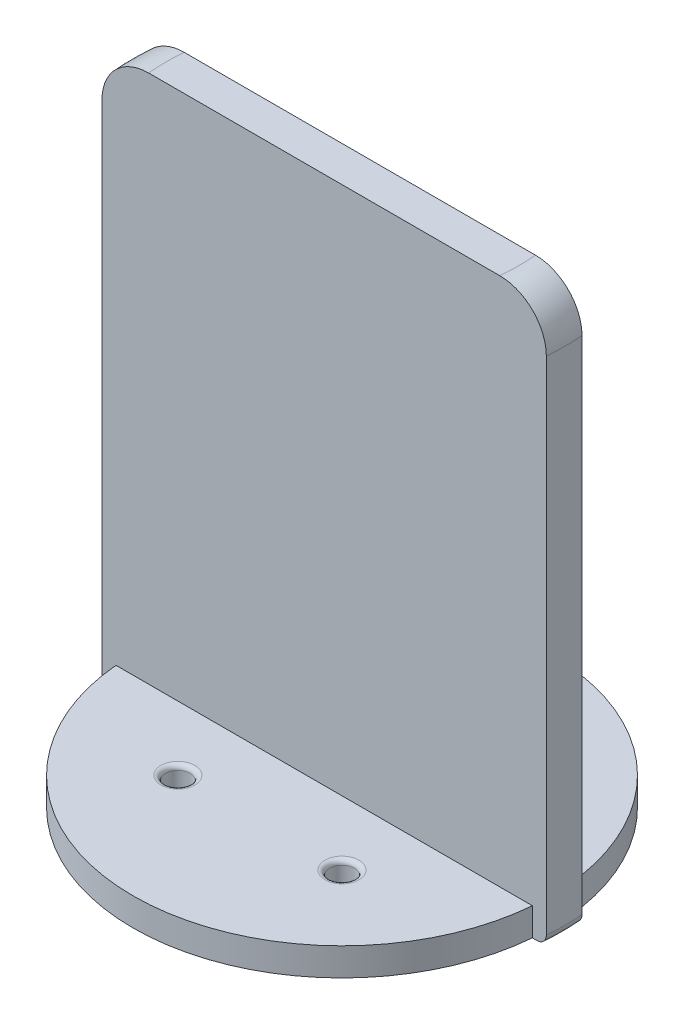
ISO-10303-21;
HEADER;
FILE_DESCRIPTION(('STEP AP214'),'2;1');
FILE_NAME('part.step','',(''),(''),'','','');
FILE_SCHEMA(('AUTOMOTIVE_DESIGN { 1 0 10303 214 1 1 1 1 }'));
ENDSEC;
DATA;
#1=APPLICATION_CONTEXT('core data for automotive mechanical design processes');
#2=APPLICATION_PROTOCOL_DEFINITION('international standard','automotive_design',2000,#1);
#3=PRODUCT_CONTEXT('',#1,'mechanical');
#4=PRODUCT('Part','Part','',(#3));
#5=PRODUCT_RELATED_PRODUCT_CATEGORY('part','',(#4));
#6=PRODUCT_DEFINITION_FORMATION('','',#4);
#7=PRODUCT_DEFINITION_CONTEXT('part definition',#1,'design');
#8=PRODUCT_DEFINITION('design','',#6,#7);
#9=PRODUCT_DEFINITION_SHAPE('','',#8);
#10=(LENGTH_UNIT() NAMED_UNIT(*) SI_UNIT(.MILLI.,.METRE.));
#11=(NAMED_UNIT(*) PLANE_ANGLE_UNIT() SI_UNIT($,.RADIAN.));
#12=(NAMED_UNIT(*) SI_UNIT($,.STERADIAN.) SOLID_ANGLE_UNIT());
#13=UNCERTAINTY_MEASURE_WITH_UNIT(LENGTH_MEASURE(1.E-05),#10,'distance_accuracy_value','');
#14=(GEOMETRIC_REPRESENTATION_CONTEXT(3) GLOBAL_UNCERTAINTY_ASSIGNED_CONTEXT((#13)) GLOBAL_UNIT_ASSIGNED_CONTEXT((#10,
#11,#12)) REPRESENTATION_CONTEXT('',''));
#15=CARTESIAN_POINT('',(0.,0.,0.));
#16=DIRECTION('',(0.,0.,1.));
#17=DIRECTION('',(1.,0.,0.));
#18=AXIS2_PLACEMENT_3D('',#15,#16,#17);
#19=CARTESIAN_POINT('',(0.,3.,0.));
#20=DIRECTION('',(0.,1.,0.));
#21=DIRECTION('',(0.,0.,1.));
#22=AXIS2_PLACEMENT_3D('',#19,#20,#21);
#23=PLANE('',#22);
#24=CARTESIAN_POINT('',(-8.83883476483186,3.,8.83883476483183));
#25=DIRECTION('',(0.,1.,0.));
#26=DIRECTION('',(0.,0.,1.));
#27=AXIS2_PLACEMENT_3D('',#24,#25,#26);
#28=CIRCLE('',#27,1.83333333333334);
#29=CARTESIAN_POINT('',(-8.83883476483186,3.,10.6721680981652));
#30=VERTEX_POINT('',#29);
#31=EDGE_CURVE('E212',#30,#30,#28,.F.);
#32=ORIENTED_EDGE('',*,*,#31,.T.);
#33=EDGE_LOOP('',(#32));
#34=FACE_BOUND('',#33,.T.);
#35=CARTESIAN_POINT('',(8.83883476483183,3.,8.83883476483186));
#36=DIRECTION('',(0.,1.,0.));
#37=DIRECTION('',(0.,0.,1.));
#38=AXIS2_PLACEMENT_3D('',#35,#36,#37);
#39=CIRCLE('',#38,1.83333333333333);
#40=CARTESIAN_POINT('',(8.83883476483183,3.,10.6721680981652));
#41=VERTEX_POINT('',#40);
#42=EDGE_CURVE('E209',#41,#41,#39,.F.);
#43=ORIENTED_EDGE('',*,*,#42,.T.);
#44=EDGE_LOOP('',(#43));
#45=FACE_BOUND('',#44,.T.);
#46=DIRECTION('',(1.,0.,0.));
#47=VECTOR('',#46,1.);
#48=CARTESIAN_POINT('',(0.,3.,1.92));
#49=LINE('',#48,#47);
#50=CARTESIAN_POINT('',(-22.4179303237386,3.,1.92));
#51=VERTEX_POINT('',#50);
#52=CARTESIAN_POINT('',(22.4179303237386,3.,1.92));
#53=VERTEX_POINT('',#52);
#54=EDGE_CURVE('E178',#51,#53,#49,.T.);
#55=ORIENTED_EDGE('',*,*,#54,.F.);
#56=CARTESIAN_POINT('',(0.,3.,0.));
#57=DIRECTION('',(0.,1.,0.));
#58=DIRECTION('',(0.,0.,1.));
#59=AXIS2_PLACEMENT_3D('',#56,#57,#58);
#60=CIRCLE('',#59,22.5);
#61=EDGE_CURVE('E149',#51,#53,#60,.T.);
#62=ORIENTED_EDGE('',*,*,#61,.T.);
#63=EDGE_LOOP('',(#55,#62));
#64=FACE_BOUND('',#63,.T.);
#65=ADVANCED_FACE('F35',(#34,#45,#64),#23,.T.);
#66=CARTESIAN_POINT('',(0.,3.,0.));
#67=DIRECTION('',(0.,-1.,0.));
#68=DIRECTION('',(0.,0.,-1.));
#69=AXIS2_PLACEMENT_3D('',#66,#67,#68);
#70=CYLINDRICAL_SURFACE('',#69,22.5);
#71=ORIENTED_EDGE('',*,*,#61,.F.);
#72=DIRECTION('',(0.,-1.,0.));
#73=VECTOR('',#72,1.);
#74=CARTESIAN_POINT('',(-22.4179303237386,3.,1.92));
#75=LINE('',#74,#73);
#76=CARTESIAN_POINT('',(-22.4179303237386,0.,1.92));
#77=VERTEX_POINT('',#76);
#78=EDGE_CURVE('E146',#51,#77,#75,.T.);
#79=ORIENTED_EDGE('',*,*,#78,.T.);
#80=CARTESIAN_POINT('',(0.,0.,0.));
#81=DIRECTION('',(0.,1.,0.));
#82=DIRECTION('',(0.,0.,1.));
#83=AXIS2_PLACEMENT_3D('',#80,#81,#82);
#84=CIRCLE('',#83,22.5);
#85=CARTESIAN_POINT('',(22.4179303237386,0.,1.92));
#86=VERTEX_POINT('',#85);
#87=EDGE_CURVE('E127',#77,#86,#84,.T.);
#88=ORIENTED_EDGE('',*,*,#87,.T.);
#89=DIRECTION('',(0.,-1.,0.));
#90=VECTOR('',#89,1.);
#91=CARTESIAN_POINT('',(22.4179303237386,3.,1.92));
#92=LINE('',#91,#90);
#93=EDGE_CURVE('E153',#86,#53,#92,.F.);
#94=ORIENTED_EDGE('',*,*,#93,.T.);
#95=EDGE_LOOP('',(#71,#79,#88,#94));
#96=FACE_BOUND('',#95,.T.);
#97=ADVANCED_FACE('F147',(#96),#70,.T.);
#98=CARTESIAN_POINT('',(-8.83883476483183,3.,-8.83883476483186));
#99=DIRECTION('',(0.,1.,0.));
#100=DIRECTION('',(0.,0.,1.));
#101=AXIS2_PLACEMENT_3D('',#98,#99,#100);
#102=CIRCLE('',#101,1.83333333333333);
#103=CARTESIAN_POINT('',(-8.83883476483183,3.,-7.00550143149853));
#104=VERTEX_POINT('',#103);
#105=EDGE_CURVE('E203',#104,#104,#102,.F.);
#106=ORIENTED_EDGE('',*,*,#105,.T.);
#107=EDGE_LOOP('',(#106));
#108=FACE_BOUND('',#107,.T.);
#109=CARTESIAN_POINT('',(8.83883476483186,3.,-8.83883476483183));
#110=DIRECTION('',(0.,1.,0.));
#111=DIRECTION('',(0.,0.,1.));
#112=AXIS2_PLACEMENT_3D('',#109,#110,#111);
#113=CIRCLE('',#112,1.83333333333333);
#114=CARTESIAN_POINT('',(8.83883476483186,3.,-7.0055014314985));
#115=VERTEX_POINT('',#114);
#116=EDGE_CURVE('E200',#115,#115,#113,.F.);
#117=ORIENTED_EDGE('',*,*,#116,.T.);
#118=EDGE_LOOP('',(#117));
#119=FACE_BOUND('',#118,.T.);
#120=DIRECTION('',(-1.,0.,0.));
#121=VECTOR('',#120,1.);
#122=CARTESIAN_POINT('',(0.,3.,-1.92));
#123=LINE('',#122,#121);
#124=CARTESIAN_POINT('',(22.4179303237386,3.,-1.92));
#125=VERTEX_POINT('',#124);
#126=CARTESIAN_POINT('',(-22.4179303237386,3.,-1.92));
#127=VERTEX_POINT('',#126);
#128=EDGE_CURVE('E168',#125,#127,#123,.T.);
#129=ORIENTED_EDGE('',*,*,#128,.F.);
#130=EDGE_CURVE('E191',#125,#127,#60,.T.);
#131=ORIENTED_EDGE('',*,*,#130,.T.);
#132=EDGE_LOOP('',(#129,#131));
#133=FACE_BOUND('',#132,.T.);
#134=ADVANCED_FACE('F334',(#108,#119,#133),#23,.T.);
#135=CARTESIAN_POINT('',(0.,0.,0.));
#136=DIRECTION('',(0.,1.,0.));
#137=DIRECTION('',(0.,0.,1.));
#138=AXIS2_PLACEMENT_3D('',#135,#136,#137);
#139=PLANE('',#138);
#140=DIRECTION('',(1.,0.,0.));
#141=VECTOR('',#140,1.);
#142=CARTESIAN_POINT('',(23.9230767252041,0.,-1.92));
#143=LINE('',#142,#141);
#144=CARTESIAN_POINT('',(22.4179303237386,0.,-1.92));
#145=VERTEX_POINT('',#144);
#146=CARTESIAN_POINT('',(22.9197207661874,0.,-1.92));
#147=VERTEX_POINT('',#146);
#148=EDGE_CURVE('E162',#145,#147,#143,.T.);
#149=ORIENTED_EDGE('',*,*,#148,.T.);
#150=CARTESIAN_POINT('',(0.,0.,0.));
#151=DIRECTION('',(0.,1.,0.));
#152=DIRECTION('',(0.,0.,1.));
#153=AXIS2_PLACEMENT_3D('',#150,#151,#152);
#154=CIRCLE('',#153,23.);
#155=CARTESIAN_POINT('',(22.9197207661873,0.,1.92));
#156=VERTEX_POINT('',#155);
#157=EDGE_CURVE('E223',#147,#156,#154,.F.);
#158=ORIENTED_EDGE('',*,*,#157,.T.);
#159=DIRECTION('',(-1.,0.,0.));
#160=VECTOR('',#159,1.);
#161=CARTESIAN_POINT('',(-23.9230767252041,0.,1.92));
#162=LINE('',#161,#160);
#163=EDGE_CURVE('E138',#156,#86,#162,.T.);
#164=ORIENTED_EDGE('',*,*,#163,.T.);
#165=ORIENTED_EDGE('',*,*,#87,.F.);
#166=CARTESIAN_POINT('',(-22.9197207661874,0.,1.92));
#167=VERTEX_POINT('',#166);
#168=EDGE_CURVE('E134',#77,#167,#162,.T.);
#169=ORIENTED_EDGE('',*,*,#168,.T.);
#170=CARTESIAN_POINT('',(0.,0.,0.));
#171=DIRECTION('',(0.,1.,0.));
#172=DIRECTION('',(0.,0.,1.));
#173=AXIS2_PLACEMENT_3D('',#170,#171,#172);
#174=CIRCLE('',#173,23.);
#175=CARTESIAN_POINT('',(-22.9197207661873,0.,-1.92));
#176=VERTEX_POINT('',#175);
#177=EDGE_CURVE('E221',#167,#176,#174,.F.);
#178=ORIENTED_EDGE('',*,*,#177,.T.);
#179=CARTESIAN_POINT('',(-22.4179303237386,0.,-1.92));
#180=VERTEX_POINT('',#179);
#181=EDGE_CURVE('E159',#176,#180,#143,.T.);
#182=ORIENTED_EDGE('',*,*,#181,.T.);
#183=EDGE_CURVE('E141',#145,#180,#84,.T.);
#184=ORIENTED_EDGE('',*,*,#183,.F.);
#185=EDGE_LOOP('',(#149,#158,#164,#165,#169,#178,#182,#184));
#186=FACE_BOUND('',#185,.T.);
#187=CARTESIAN_POINT('',(8.83883476483186,0.,-8.83883476483183));
#188=DIRECTION('',(0.,1.,0.));
#189=DIRECTION('',(0.,0.,1.));
#190=AXIS2_PLACEMENT_3D('',#187,#188,#189);
#191=CIRCLE('',#190,1.33333333333333);
#192=CARTESIAN_POINT('',(8.83883476483186,0.,-7.5055014314985));
#193=VERTEX_POINT('',#192);
#194=EDGE_CURVE('E142',#193,#193,#191,.T.);
#195=ORIENTED_EDGE('',*,*,#194,.T.);
#196=EDGE_LOOP('',(#195));
#197=FACE_BOUND('',#196,.T.);
#198=CARTESIAN_POINT('',(-8.83883476483183,0.,-8.83883476483186));
#199=DIRECTION('',(0.,1.,0.));
#200=DIRECTION('',(0.,0.,1.));
#201=AXIS2_PLACEMENT_3D('',#198,#199,#200);
#202=CIRCLE('',#201,1.33333333333333);
#203=CARTESIAN_POINT('',(-8.83883476483183,0.,-7.50550143149853));
#204=VERTEX_POINT('',#203);
#205=EDGE_CURVE('E180',#204,#204,#202,.T.);
#206=ORIENTED_EDGE('',*,*,#205,.T.);
#207=EDGE_LOOP('',(#206));
#208=FACE_BOUND('',#207,.T.);
#209=CARTESIAN_POINT('',(-8.83883476483186,0.,8.83883476483183));
#210=DIRECTION('',(0.,1.,0.));
#211=DIRECTION('',(0.,0.,1.));
#212=AXIS2_PLACEMENT_3D('',#209,#210,#211);
#213=CIRCLE('',#212,1.33333333333334);
#214=CARTESIAN_POINT('',(-8.83883476483186,0.,10.1721680981652));
#215=VERTEX_POINT('',#214);
#216=EDGE_CURVE('E183',#215,#215,#213,.T.);
#217=ORIENTED_EDGE('',*,*,#216,.T.);
#218=EDGE_LOOP('',(#217));
#219=FACE_BOUND('',#218,.T.);
#220=CARTESIAN_POINT('',(8.83883476483183,0.,8.83883476483186));
#221=DIRECTION('',(0.,1.,0.));
#222=DIRECTION('',(0.,0.,1.));
#223=AXIS2_PLACEMENT_3D('',#220,#221,#222);
#224=CIRCLE('',#223,1.33333333333333);
#225=CARTESIAN_POINT('',(8.83883476483183,0.,10.1721680981652));
#226=VERTEX_POINT('',#225);
#227=EDGE_CURVE('E186',#226,#226,#224,.T.);
#228=ORIENTED_EDGE('',*,*,#227,.T.);
#229=EDGE_LOOP('',(#228));
#230=FACE_BOUND('',#229,.T.);
#231=ADVANCED_FACE('F130',(#186,#197,#208,#219,#230),#139,.F.);
#232=ORIENTED_EDGE('',*,*,#130,.F.);
#233=DIRECTION('',(0.,-1.,0.));
#234=VECTOR('',#233,1.);
#235=CARTESIAN_POINT('',(22.4179303237386,3.,-1.92));
#236=LINE('',#235,#234);
#237=EDGE_CURVE('E195',#125,#145,#236,.T.);
#238=ORIENTED_EDGE('',*,*,#237,.T.);
#239=ORIENTED_EDGE('',*,*,#183,.T.);
#240=DIRECTION('',(0.,-1.,0.));
#241=VECTOR('',#240,1.);
#242=CARTESIAN_POINT('',(-22.4179303237386,3.,-1.92));
#243=LINE('',#242,#241);
#244=EDGE_CURVE('E193',#180,#127,#243,.F.);
#245=ORIENTED_EDGE('',*,*,#244,.T.);
#246=EDGE_LOOP('',(#232,#238,#239,#245));
#247=FACE_BOUND('',#246,.T.);
#248=ADVANCED_FACE('F330',(#247),#70,.T.);
#249=CARTESIAN_POINT('',(8.83883476483186,3.,-8.83883476483183));
#250=DIRECTION('',(0.,-1.,0.));
#251=DIRECTION('',(0.,0.,-1.));
#252=AXIS2_PLACEMENT_3D('',#249,#250,#251);
#253=CYLINDRICAL_SURFACE('',#252,1.33333333333333);
#254=CARTESIAN_POINT('',(8.83883476483186,2.5,-8.83883476483183));
#255=DIRECTION('',(0.,1.,0.));
#256=DIRECTION('',(0.,0.,1.));
#257=AXIS2_PLACEMENT_3D('',#254,#255,#256);
#258=CIRCLE('',#257,1.33333333333333);
#259=CARTESIAN_POINT('',(8.83883476483186,2.5,-7.5055014314985));
#260=VERTEX_POINT('',#259);
#261=EDGE_CURVE('E218',#260,#260,#258,.T.);
#262=ORIENTED_EDGE('',*,*,#261,.T.);
#263=EDGE_LOOP('',(#262));
#264=FACE_BOUND('',#263,.T.);
#265=ORIENTED_EDGE('',*,*,#194,.F.);
#266=EDGE_LOOP('',(#265));
#267=FACE_BOUND('',#266,.T.);
#268=ADVANCED_FACE('F380',(#264,#267),#253,.F.);
#269=CARTESIAN_POINT('',(8.83883476483183,3.,8.83883476483186));
#270=DIRECTION('',(0.,-1.,0.));
#271=DIRECTION('',(0.,0.,-1.));
#272=AXIS2_PLACEMENT_3D('',#269,#270,#271);
#273=CYLINDRICAL_SURFACE('',#272,1.33333333333333);
#274=CARTESIAN_POINT('',(8.83883476483183,2.5,8.83883476483186));
#275=DIRECTION('',(0.,1.,0.));
#276=DIRECTION('',(0.,0.,1.));
#277=AXIS2_PLACEMENT_3D('',#274,#275,#276);
#278=CIRCLE('',#277,1.33333333333333);
#279=CARTESIAN_POINT('',(8.83883476483183,2.5,10.1721680981652));
#280=VERTEX_POINT('',#279);
#281=EDGE_CURVE('E215',#280,#280,#278,.T.);
#282=ORIENTED_EDGE('',*,*,#281,.T.);
#283=EDGE_LOOP('',(#282));
#284=FACE_BOUND('',#283,.T.);
#285=ORIENTED_EDGE('',*,*,#227,.F.);
#286=EDGE_LOOP('',(#285));
#287=FACE_BOUND('',#286,.T.);
#288=ADVANCED_FACE('F384',(#284,#287),#273,.F.);
#289=CARTESIAN_POINT('',(-8.83883476483186,3.,8.83883476483183));
#290=DIRECTION('',(0.,-1.,0.));
#291=DIRECTION('',(0.,0.,-1.));
#292=AXIS2_PLACEMENT_3D('',#289,#290,#291);
#293=CYLINDRICAL_SURFACE('',#292,1.33333333333334);
#294=CARTESIAN_POINT('',(-8.83883476483186,2.5,8.83883476483183));
#295=DIRECTION('',(0.,1.,0.));
#296=DIRECTION('',(0.,0.,1.));
#297=AXIS2_PLACEMENT_3D('',#294,#295,#296);
#298=CIRCLE('',#297,1.33333333333334);
#299=CARTESIAN_POINT('',(-8.83883476483186,2.5,10.1721680981652));
#300=VERTEX_POINT('',#299);
#301=EDGE_CURVE('E206',#300,#300,#298,.T.);
#302=ORIENTED_EDGE('',*,*,#301,.T.);
#303=EDGE_LOOP('',(#302));
#304=FACE_BOUND('',#303,.T.);
#305=ORIENTED_EDGE('',*,*,#216,.F.);
#306=EDGE_LOOP('',(#305));
#307=FACE_BOUND('',#306,.T.);
#308=ADVANCED_FACE('F389',(#304,#307),#293,.F.);
#309=CARTESIAN_POINT('',(-8.83883476483183,3.,-8.83883476483186));
#310=DIRECTION('',(0.,-1.,0.));
#311=DIRECTION('',(0.,0.,-1.));
#312=AXIS2_PLACEMENT_3D('',#309,#310,#311);
#313=CYLINDRICAL_SURFACE('',#312,1.33333333333333);
#314=CARTESIAN_POINT('',(-8.83883476483183,2.5,-8.83883476483186));
#315=DIRECTION('',(0.,1.,0.));
#316=DIRECTION('',(0.,0.,1.));
#317=AXIS2_PLACEMENT_3D('',#314,#315,#316);
#318=CIRCLE('',#317,1.33333333333333);
#319=CARTESIAN_POINT('',(-8.83883476483183,2.5,-7.50550143149853));
#320=VERTEX_POINT('',#319);
#321=EDGE_CURVE('E152',#320,#320,#318,.T.);
#322=ORIENTED_EDGE('',*,*,#321,.T.);
#323=EDGE_LOOP('',(#322));
#324=FACE_BOUND('',#323,.T.);
#325=ORIENTED_EDGE('',*,*,#205,.F.);
#326=EDGE_LOOP('',(#325));
#327=FACE_BOUND('',#326,.T.);
#328=ADVANCED_FACE('F395',(#324,#327),#313,.F.);
#329=CARTESIAN_POINT('',(-23.9230767252041,60.,1.92));
#330=DIRECTION('',(0.,0.,1.));
#331=DIRECTION('',(1.,0.,0.));
#332=AXIS2_PLACEMENT_3D('',#329,#330,#331);
#333=PLANE('',#332);
#334=DIRECTION('',(0.,-1.,0.));
#335=VECTOR('',#334,1.);
#336=CARTESIAN_POINT('',(23.9230767252041,60.,1.92));
#337=LINE('',#336,#335);
#338=CARTESIAN_POINT('',(23.9230767252041,55.,1.92));
#339=VERTEX_POINT('',#338);
#340=CARTESIAN_POINT('',(23.9230767252041,1.,1.92));
#341=VERTEX_POINT('',#340);
#342=EDGE_CURVE('E169',#339,#341,#337,.T.);
#343=ORIENTED_EDGE('',*,*,#342,.F.);
#344=CARTESIAN_POINT('',(23.9230767252041,55.,1.92));
#345=CARTESIAN_POINT('',(23.923092065447,55.1402815239521,1.92));
#346=CARTESIAN_POINT('',(23.9171547172522,55.2805607471091,1.92));
#347=CARTESIAN_POINT('',(23.8934855131935,55.5601134557584,1.92));
#348=CARTESIAN_POINT('',(23.8757542841699,55.699386994305,1.92));
#349=CARTESIAN_POINT('',(23.8286278254067,55.9758269979905,1.92));
#350=CARTESIAN_POINT('',(23.7992423356042,56.1129951235285,1.92));
#351=CARTESIAN_POINT('',(23.72902438885,56.384367593609,1.92));
#352=CARTESIAN_POINT('',(23.6881920607012,56.5185719714821,1.92));
#353=CARTESIAN_POINT('',(23.5953605371227,56.7831027159765,1.92));
#354=CARTESIAN_POINT('',(23.5433582744866,56.9134280062061,1.92));
#355=CARTESIAN_POINT('',(23.4285471430982,57.1692859755791,1.92));
#356=CARTESIAN_POINT('',(23.3657342882026,57.2948168659675,1.92));
#357=CARTESIAN_POINT('',(23.2298029697039,57.5400823929497,1.92));
#358=CARTESIAN_POINT('',(23.1566899437505,57.6598200433799,1.92));
#359=CARTESIAN_POINT('',(23.0006291950561,57.8927687372967,1.92));
#360=CARTESIAN_POINT('',(22.9176778541397,58.005977356752,1.92));
#361=CARTESIAN_POINT('',(22.7424826410944,58.2251163244722,1.92));
#362=CARTESIAN_POINT('',(22.6502310084623,58.3310404682509,1.92));
#363=CARTESIAN_POINT('',(22.4571179971419,58.5348004331751,1.92));
#364=CARTESIAN_POINT('',(22.3562534291252,58.6326332315054,1.92));
#365=CARTESIAN_POINT('',(22.1466830368639,58.8194661826934,1.92));
#366=CARTESIAN_POINT('',(22.0379785781474,58.9084678673423,1.92));
#367=CARTESIAN_POINT('',(21.813447296666,59.0770688190564,1.92));
#368=CARTESIAN_POINT('',(21.6976179450417,59.1566647180755,1.92));
#369=CARTESIAN_POINT('',(21.4593266380576,59.3060968267906,1.92));
#370=CARTESIAN_POINT('',(21.3368453063605,59.3759021406411,1.92));
#371=CARTESIAN_POINT('',(21.0864526458605,59.5049778764308,1.92));
#372=CARTESIAN_POINT('',(20.9585412688847,59.5642482048843,1.92));
#373=CARTESIAN_POINT('',(20.6982451695889,59.6718242942346,1.92));
#374=CARTESIAN_POINT('',(20.5658623338848,59.7201346146391,1.92));
#375=CARTESIAN_POINT('',(20.2975629861563,59.8054827831017,1.92));
#376=CARTESIAN_POINT('',(20.1616472070213,59.8425229491514,1.92));
#377=CARTESIAN_POINT('',(19.8404630255478,59.9157383039982,1.92));
#378=CARTESIAN_POINT('',(19.6541209720505,59.9473409595548,1.92));
#379=CARTESIAN_POINT('',(19.3730745377296,59.9789359354723,1.92));
#380=CARTESIAN_POINT('',(19.2791850069226,59.9868327552837,1.92));
#381=CARTESIAN_POINT('',(19.0911184324358,59.9973640573422,1.92));
#382=CARTESIAN_POINT('',(18.9969414113552,59.9999989430703,1.92));
#383=CARTESIAN_POINT('',(18.9027405420484,60.,1.92));
#384=B_SPLINE_CURVE_WITH_KNOTS('',3,(#344,#345,#346,#347,#348,#349,#350,#351,#352,#353,#354,
#355,#356,#357,#358,#359,#360,#361,#362,#363,#364,#365,#366,#367,#368,#369,#370,#371,#372,#373,
#374,#375,#376,#377,#378,#379,#380,#381,#382,#383),.UNSPECIFIED.,.F.,.F.,(4,2,2,2,2,2,2,2,2,2,2,
2,2,2,2,2,2,2,2,4),(0.,0.420715711336164,0.841409063578893,1.26175156377587,1.68208933435349,
2.10254267540665,2.52315138186318,2.94353886757146,3.36408143875345,3.78497787711049,
4.20603085292139,4.62701066731426,5.04814077327742,5.47057128459452,5.89300554430417,
6.315263742218,6.73743503327836,7.30308942086365,7.58562917242358,7.86814725821996),.UNSPECIFIED.);
#385=CARTESIAN_POINT('',(18.9027405420484,60.,1.92));
#386=VERTEX_POINT('',#385);
#387=EDGE_CURVE('E300',#339,#386,#384,.T.);
#388=ORIENTED_EDGE('',*,*,#387,.T.);
#389=DIRECTION('',(-1.,0.,0.));
#390=VECTOR('',#389,1.);
#391=CARTESIAN_POINT('',(-23.9230767252041,60.,1.92));
#392=LINE('',#391,#390);
#393=CARTESIAN_POINT('',(-18.9027405420484,60.,1.92));
#394=VERTEX_POINT('',#393);
#395=EDGE_CURVE('E175',#386,#394,#392,.T.);
#396=ORIENTED_EDGE('',*,*,#395,.T.);
#397=CARTESIAN_POINT('',(-18.9027405420484,60.,1.92));
#398=CARTESIAN_POINT('',(-19.0444145533125,60.0000149098157,1.92));
#399=CARTESIAN_POINT('',(-19.1860873169157,59.9940406450894,1.92));
#400=CARTESIAN_POINT('',(-19.468426388916,59.9702126964013,1.92));
#401=CARTESIAN_POINT('',(-19.6090927261556,59.9523593542636,1.92));
#402=CARTESIAN_POINT('',(-19.888340760768,59.9048861941943,1.92));
#403=CARTESIAN_POINT('',(-20.0269236403544,59.8752733323299,1.92));
#404=CARTESIAN_POINT('',(-20.3011018350406,59.8044850647959,1.92));
#405=CARTESIAN_POINT('',(-20.4366972009256,59.7633098558408,1.92));
#406=CARTESIAN_POINT('',(-20.7039888352687,59.6696575553217,1.92));
#407=CARTESIAN_POINT('',(-20.8356835140493,59.6171759261345,1.92));
#408=CARTESIAN_POINT('',(-21.0942208158734,59.5012619045834,1.92));
#409=CARTESIAN_POINT('',(-21.2210616324273,59.4378254826141,1.92));
#410=CARTESIAN_POINT('',(-21.4688542966854,59.3004977397098,1.92));
#411=CARTESIAN_POINT('',(-21.5898095568934,59.2266125765298,1.92));
#412=CARTESIAN_POINT('',(-21.8250793925478,59.0688500203699,1.92));
#413=CARTESIAN_POINT('',(-21.9393916535528,58.9849691755471,1.92));
#414=CARTESIAN_POINT('',(-22.1601564261033,58.8081052318201,1.92));
#415=CARTESIAN_POINT('',(-22.2666323886262,58.7151514041417,1.92));
#416=CARTESIAN_POINT('',(-22.4713487114536,58.5205789681616,1.92));
#417=CARTESIAN_POINT('',(-22.5695891035236,58.4189603932839,1.92));
#418=CARTESIAN_POINT('',(-22.7571587967294,58.2077387410946,1.92));
#419=CARTESIAN_POINT('',(-22.8464847419402,58.098132683488,1.92));
#420=CARTESIAN_POINT('',(-23.0155052096825,57.8717901834568,1.92));
#421=CARTESIAN_POINT('',(-23.0952031163691,57.7550562682461,1.92));
#422=CARTESIAN_POINT('',(-23.2441778933669,57.5156526346824,1.92));
#423=CARTESIAN_POINT('',(-23.3134882958903,57.3930037829656,1.92));
#424=CARTESIAN_POINT('',(-23.4414761477294,57.1423364702601,1.92));
#425=CARTESIAN_POINT('',(-23.5001575130632,57.0143200083353,1.92));
#426=CARTESIAN_POINT('',(-23.6064764867813,56.7538239520076,1.92));
#427=CARTESIAN_POINT('',(-23.6541176961134,56.6213458290496,1.92));
#428=CARTESIAN_POINT('',(-23.7380230402041,56.3528898035617,1.92));
#429=CARTESIAN_POINT('',(-23.7742900144668,56.2169127836954,1.92));
#430=CARTESIAN_POINT('',(-23.8440543953249,55.9024260162317,1.92));
#431=CARTESIAN_POINT('',(-23.8736870608179,55.7230350381422,1.92));
#432=CARTESIAN_POINT('',(-23.9033175370195,55.4525506207191,1.92));
#433=CARTESIAN_POINT('',(-23.9107246020195,55.3622031032323,1.92));
#434=CARTESIAN_POINT('',(-23.9206036491007,55.181244206285,1.92));
#435=CARTESIAN_POINT('',(-23.923075935114,55.0906328434191,1.92));
#436=CARTESIAN_POINT('',(-23.9230767252041,55.,1.92));
#437=B_SPLINE_CURVE_WITH_KNOTS('',3,(#397,#398,#399,#400,#401,#402,#403,#404,#405,#406,#407,
#408,#409,#410,#411,#412,#413,#414,#415,#416,#417,#418,#419,#420,#421,#422,#423,#424,#425,#426,
#427,#428,#429,#430,#431,#432,#433,#434,#435,#436),.UNSPECIFIED.,.F.,.F.,(4,2,2,2,2,2,2,2,2,2,2,
2,2,2,2,2,2,2,2,4),(0.,0.424894439409755,0.849776652882453,1.2744079107651,1.69903194467448,
2.12382671213096,2.54877807001154,2.97348002700572,3.39832907513728,3.82185013754166,
4.24536956629977,4.66904783610057,5.09257675143376,5.51470756325672,5.93668253319044,
6.35851967398138,6.78025142188056,7.32448921376637,7.59632791070771,7.86814986463583),.UNSPECIFIED.);
#438=CARTESIAN_POINT('',(-23.9230767252041,55.,1.92));
#439=VERTEX_POINT('',#438);
#440=EDGE_CURVE('E301',#394,#439,#437,.T.);
#441=ORIENTED_EDGE('',*,*,#440,.T.);
#442=DIRECTION('',(0.,-1.,0.));
#443=VECTOR('',#442,1.);
#444=CARTESIAN_POINT('',(-23.9230767252041,60.,1.92));
#445=LINE('',#444,#443);
#446=CARTESIAN_POINT('',(-23.9230767252041,1.,1.92));
#447=VERTEX_POINT('',#446);
#448=EDGE_CURVE('E166',#439,#447,#445,.T.);
#449=ORIENTED_EDGE('',*,*,#448,.T.);
#450=CARTESIAN_POINT('',(-23.9230767252041,1.,1.92));
#451=CARTESIAN_POINT('',(-23.9230765841052,0.971931600617623,1.92));
#452=CARTESIAN_POINT('',(-23.9218904250238,0.943876670046512,1.92));
#453=CARTESIAN_POINT('',(-23.9171586649778,0.887968052211157,1.92));
#454=CARTESIAN_POINT('',(-23.9136131917221,0.860114354136756,1.92));
#455=CARTESIAN_POINT('',(-23.8994728893864,0.777208085022869,1.92));
#456=CARTESIAN_POINT('',(-23.8853740760419,0.722711638073133,1.92));
#457=CARTESIAN_POINT('',(-23.8482305659413,0.616862028965631,1.92));
#458=CARTESIAN_POINT('',(-23.8251818447442,0.565510292910651,1.92));
#459=CARTESIAN_POINT('',(-23.7708039348162,0.467398508362663,1.92));
#460=CARTESIAN_POINT('',(-23.7394759994887,0.420637766300231,1.92));
#461=CARTESIAN_POINT('',(-23.6693880798885,0.332962303506235,1.92));
#462=CARTESIAN_POINT('',(-23.6306179639996,0.29205568650868,1.92));
#463=CARTESIAN_POINT('',(-23.5467701731269,0.217299480019489,1.92));
#464=CARTESIAN_POINT('',(-23.5016912347563,0.183451307420906,1.92));
#465=CARTESIAN_POINT('',(-23.4063621785124,0.123667622169788,1.92));
#466=CARTESIAN_POINT('',(-23.356095783554,0.0977580946669391,1.92));
#467=CARTESIAN_POINT('',(-23.2519448693048,0.0547288073639613,1.92));
#468=CARTESIAN_POINT('',(-23.1980623057693,0.0376043389217097,1.92));
#469=CARTESIAN_POINT('',(-23.106511098883,0.0167619903177402,1.92));
#470=CARTESIAN_POINT('',(-23.0694055992033,0.0104799233122167,1.92));
#471=CARTESIAN_POINT('',(-22.994778675417,0.00209939349439259,1.92));
#472=CARTESIAN_POINT('',(-22.9572579178271,-5.00603338562804E-06,1.92));
#473=CARTESIAN_POINT('',(-22.9197207661874,0.,1.92));
#474=B_SPLINE_CURVE_WITH_KNOTS('',3,(#450,#451,#452,#453,#454,#455,#456,#457,#458,#459,#460,
#461,#462,#463,#464,#465,#466,#467,#468,#469,#470,#471,#472,#473),.UNSPECIFIED.,.F.,.F.,(4,2,2,
2,2,2,2,2,2,2,2,4),(0.,0.0841534016755556,0.168302248527354,0.336307613394861,0.504388611679421,
0.672444178477936,0.840730176051368,1.00904992245158,1.1779148759432,1.34668922588356,
1.45937004773957,1.57189062845452),.UNSPECIFIED.);
#475=EDGE_CURVE('E158',#447,#167,#474,.T.);
#476=ORIENTED_EDGE('',*,*,#475,.T.);
#477=ORIENTED_EDGE('',*,*,#168,.F.);
#478=ORIENTED_EDGE('',*,*,#78,.F.);
#479=ORIENTED_EDGE('',*,*,#54,.T.);
#480=ORIENTED_EDGE('',*,*,#93,.F.);
#481=ORIENTED_EDGE('',*,*,#163,.F.);
#482=CARTESIAN_POINT('',(22.9197207661874,0.,1.92));
#483=CARTESIAN_POINT('',(22.9480207418065,2.40225096808318E-07,1.92));
#484=CARTESIAN_POINT('',(22.9763071982775,0.00119370628753826,1.92));
#485=CARTESIAN_POINT('',(23.0326783319583,0.00595546792826653,1.92));
#486=CARTESIAN_POINT('',(23.0607630171492,0.00952366904517103,1.92));
#487=CARTESIAN_POINT('',(23.144369414907,0.0237583935932113,1.92));
#488=CARTESIAN_POINT('',(23.1993320789843,0.0379551218721057,1.92));
#489=CARTESIAN_POINT('',(23.3060937184228,0.0753780204409981,1.92));
#490=CARTESIAN_POINT('',(23.3578910321269,0.098608886895752,1.92));
#491=CARTESIAN_POINT('',(23.456838661544,0.153448233199482,1.92));
#492=CARTESIAN_POINT('',(23.5039899363838,0.185054978942951,1.92));
#493=CARTESIAN_POINT('',(23.592219763893,0.255698811375685,1.92));
#494=CARTESIAN_POINT('',(23.6333083518272,0.294723368989858,1.92));
#495=CARTESIAN_POINT('',(23.7083341247827,0.379146124444829,1.92));
#496=CARTESIAN_POINT('',(23.7422699508587,0.424545530711084,1.92));
#497=CARTESIAN_POINT('',(23.801905198851,0.520270297943348,1.92));
#498=CARTESIAN_POINT('',(23.8276289574583,0.57058051586848,1.92));
#499=CARTESIAN_POINT('',(23.8702233275238,0.674803397593804,1.92));
#500=CARTESIAN_POINT('',(23.8870995340895,0.728713760316553,1.92));
#501=CARTESIAN_POINT('',(23.9072093981212,0.819143122462506,1.92));
#502=CARTESIAN_POINT('',(23.9131560858344,0.855081908708367,1.92));
#503=CARTESIAN_POINT('',(23.9210891217029,0.927341981841574,1.92));
#504=CARTESIAN_POINT('',(23.9230811016646,0.963662650638358,1.92));
#505=CARTESIAN_POINT('',(23.9230767252041,1.,1.92));
#506=B_SPLINE_CURVE_WITH_KNOTS('',3,(#482,#483,#484,#485,#486,#487,#488,#489,#490,#491,#492,
#493,#494,#495,#496,#497,#498,#499,#500,#501,#502,#503,#504,#505),.UNSPECIFIED.,.F.,.F.,(4,2,2,
2,2,2,2,2,2,2,2,4),(0.,0.0848478924507088,0.169692410053266,0.339118994829744,0.508633769646343,
0.678113476245111,0.847309426284308,1.01653749275783,1.18525928856856,1.35387425722944,
1.46295470053735,1.57187969320256),.UNSPECIFIED.);
#507=EDGE_CURVE('E232',#156,#341,#506,.T.);
#508=ORIENTED_EDGE('',*,*,#507,.T.);
#509=EDGE_LOOP('',(#343,#388,#396,#441,#449,#476,#477,#478,#479,#480,#481,#508));
#510=FACE_BOUND('',#509,.T.);
#511=ADVANCED_FACE('F156',(#510),#333,.T.);
#512=CARTESIAN_POINT('',(23.9230767252041,60.,-1.92));
#513=DIRECTION('',(0.,0.,-1.));
#514=DIRECTION('',(-1.,0.,0.));
#515=AXIS2_PLACEMENT_3D('',#512,#513,#514);
#516=PLANE('',#515);
#517=DIRECTION('',(1.,0.,0.));
#518=VECTOR('',#517,1.);
#519=CARTESIAN_POINT('',(23.9230767252041,60.,-1.92));
#520=LINE('',#519,#518);
#521=CARTESIAN_POINT('',(-18.9027405420484,60.,-1.92));
#522=VERTEX_POINT('',#521);
#523=CARTESIAN_POINT('',(18.9027405420484,60.,-1.92));
#524=VERTEX_POINT('',#523);
#525=EDGE_CURVE('E161',#522,#524,#520,.T.);
#526=ORIENTED_EDGE('',*,*,#525,.T.);
#527=CARTESIAN_POINT('',(18.9027405420484,60.,-1.92));
#528=CARTESIAN_POINT('',(19.0444145533125,60.0000149098157,-1.92));
#529=CARTESIAN_POINT('',(19.1860873169157,59.9940406450894,-1.92));
#530=CARTESIAN_POINT('',(19.468426388916,59.9702126964013,-1.92));
#531=CARTESIAN_POINT('',(19.6090927261556,59.9523593542636,-1.92));
#532=CARTESIAN_POINT('',(19.888340760768,59.9048861941943,-1.92));
#533=CARTESIAN_POINT('',(20.0269236403544,59.8752733323299,-1.92));
#534=CARTESIAN_POINT('',(20.3011018350406,59.8044850647959,-1.92));
#535=CARTESIAN_POINT('',(20.4366972009256,59.7633098558408,-1.92));
#536=CARTESIAN_POINT('',(20.7039888352687,59.6696575553217,-1.92));
#537=CARTESIAN_POINT('',(20.8356835140493,59.6171759261345,-1.92));
#538=CARTESIAN_POINT('',(21.0942208158734,59.5012619045834,-1.92));
#539=CARTESIAN_POINT('',(21.2210616324273,59.4378254826141,-1.92));
#540=CARTESIAN_POINT('',(21.4688542966854,59.3004977397098,-1.92));
#541=CARTESIAN_POINT('',(21.5898095568934,59.2266125765298,-1.92));
#542=CARTESIAN_POINT('',(21.8250793925478,59.0688500203699,-1.92));
#543=CARTESIAN_POINT('',(21.9393916535528,58.9849691755471,-1.92));
#544=CARTESIAN_POINT('',(22.1601564261033,58.8081052318201,-1.92));
#545=CARTESIAN_POINT('',(22.2666323886262,58.7151514041417,-1.92));
#546=CARTESIAN_POINT('',(22.4713487114536,58.5205789681616,-1.92));
#547=CARTESIAN_POINT('',(22.5695891035236,58.4189603932839,-1.92));
#548=CARTESIAN_POINT('',(22.7571587967294,58.2077387410946,-1.92));
#549=CARTESIAN_POINT('',(22.8464847419402,58.098132683488,-1.92));
#550=CARTESIAN_POINT('',(23.0155052096825,57.8717901834568,-1.92));
#551=CARTESIAN_POINT('',(23.0952031163691,57.7550562682461,-1.92));
#552=CARTESIAN_POINT('',(23.2441778933669,57.5156526346824,-1.92));
#553=CARTESIAN_POINT('',(23.3134882958903,57.3930037829656,-1.92));
#554=CARTESIAN_POINT('',(23.4414761477294,57.1423364702601,-1.92));
#555=CARTESIAN_POINT('',(23.5001575130632,57.0143200083353,-1.92));
#556=CARTESIAN_POINT('',(23.6064764867813,56.7538239520076,-1.92));
#557=CARTESIAN_POINT('',(23.6541176961134,56.6213458290496,-1.92));
#558=CARTESIAN_POINT('',(23.7380230402041,56.3528898035617,-1.92));
#559=CARTESIAN_POINT('',(23.7742900144668,56.2169127836954,-1.92));
#560=CARTESIAN_POINT('',(23.8440543953249,55.9024260162317,-1.92));
#561=CARTESIAN_POINT('',(23.8736870608179,55.7230350381422,-1.92));
#562=CARTESIAN_POINT('',(23.9033175370195,55.4525506207191,-1.92));
#563=CARTESIAN_POINT('',(23.9107246020195,55.3622031032323,-1.92));
#564=CARTESIAN_POINT('',(23.9206036491007,55.181244206285,-1.92));
#565=CARTESIAN_POINT('',(23.923075935114,55.0906328434191,-1.92));
#566=CARTESIAN_POINT('',(23.9230767252041,55.,-1.92));
#567=B_SPLINE_CURVE_WITH_KNOTS('',3,(#527,#528,#529,#530,#531,#532,#533,#534,#535,#536,#537,
#538,#539,#540,#541,#542,#543,#544,#545,#546,#547,#548,#549,#550,#551,#552,#553,#554,#555,#556,
#557,#558,#559,#560,#561,#562,#563,#564,#565,#566),.UNSPECIFIED.,.F.,.F.,(4,2,2,2,2,2,2,2,2,2,2,
2,2,2,2,2,2,2,2,4),(0.,0.424894439409755,0.849776652882453,1.2744079107651,1.69903194467448,
2.12382671213096,2.54877807001154,2.97348002700572,3.39832907513728,3.82185013754166,
4.24536956629977,4.66904783610057,5.09257675143376,5.51470756325672,5.93668253319044,
6.35851967398138,6.78025142188056,7.32448921376637,7.59632791070771,7.86814986463583),.UNSPECIFIED.);
#568=CARTESIAN_POINT('',(23.9230767252041,55.,-1.92));
#569=VERTEX_POINT('',#568);
#570=EDGE_CURVE('E44',#524,#569,#567,.T.);
#571=ORIENTED_EDGE('',*,*,#570,.T.);
#572=DIRECTION('',(0.,-1.,0.));
#573=VECTOR('',#572,1.);
#574=CARTESIAN_POINT('',(23.9230767252041,60.,-1.92));
#575=LINE('',#574,#573);
#576=CARTESIAN_POINT('',(23.9230767252041,1.,-1.92));
#577=VERTEX_POINT('',#576);
#578=EDGE_CURVE('E171',#569,#577,#575,.T.);
#579=ORIENTED_EDGE('',*,*,#578,.T.);
#580=CARTESIAN_POINT('',(23.9230767252041,1.,-1.92));
#581=CARTESIAN_POINT('',(23.9230765841052,0.971931600617623,-1.92));
#582=CARTESIAN_POINT('',(23.9218904250238,0.943876670046512,-1.92));
#583=CARTESIAN_POINT('',(23.9171586649778,0.887968052211157,-1.92));
#584=CARTESIAN_POINT('',(23.9136131917221,0.860114354136756,-1.92));
#585=CARTESIAN_POINT('',(23.8994728893864,0.777208085022869,-1.92));
#586=CARTESIAN_POINT('',(23.8853740760419,0.722711638073133,-1.92));
#587=CARTESIAN_POINT('',(23.8482305659413,0.616862028965631,-1.92));
#588=CARTESIAN_POINT('',(23.8251818447442,0.565510292910651,-1.92));
#589=CARTESIAN_POINT('',(23.7708039348162,0.467398508362663,-1.92));
#590=CARTESIAN_POINT('',(23.7394759994887,0.420637766300231,-1.92));
#591=CARTESIAN_POINT('',(23.6693880798885,0.332962303506235,-1.92));
#592=CARTESIAN_POINT('',(23.6306179639996,0.29205568650868,-1.92));
#593=CARTESIAN_POINT('',(23.5467701731269,0.217299480019489,-1.92));
#594=CARTESIAN_POINT('',(23.5016912347563,0.183451307420906,-1.92));
#595=CARTESIAN_POINT('',(23.4063621785124,0.123667622169788,-1.92));
#596=CARTESIAN_POINT('',(23.356095783554,0.0977580946669391,-1.92));
#597=CARTESIAN_POINT('',(23.2519448693048,0.0547288073639613,-1.92));
#598=CARTESIAN_POINT('',(23.1980623057693,0.0376043389217097,-1.92));
#599=CARTESIAN_POINT('',(23.106511098883,0.0167619903177402,-1.92));
#600=CARTESIAN_POINT('',(23.0694055992033,0.0104799233122167,-1.92));
#601=CARTESIAN_POINT('',(22.994778675417,0.00209939349439259,-1.92));
#602=CARTESIAN_POINT('',(22.9572579178271,-5.00603338562804E-06,-1.92));
#603=CARTESIAN_POINT('',(22.9197207661874,0.,-1.92));
#604=B_SPLINE_CURVE_WITH_KNOTS('',3,(#580,#581,#582,#583,#584,#585,#586,#587,#588,#589,#590,
#591,#592,#593,#594,#595,#596,#597,#598,#599,#600,#601,#602,#603),.UNSPECIFIED.,.F.,.F.,(4,2,2,
2,2,2,2,2,2,2,2,4),(0.,0.0841534016755556,0.168302248527354,0.336307613394861,0.504388611679421,
0.672444178477936,0.840730176051368,1.00904992245158,1.1779148759432,1.34668922588356,
1.45937004773957,1.57189062845452),.UNSPECIFIED.);
#605=EDGE_CURVE('E261',#577,#147,#604,.T.);
#606=ORIENTED_EDGE('',*,*,#605,.T.);
#607=ORIENTED_EDGE('',*,*,#148,.F.);
#608=ORIENTED_EDGE('',*,*,#237,.F.);
#609=ORIENTED_EDGE('',*,*,#128,.T.);
#610=ORIENTED_EDGE('',*,*,#244,.F.);
#611=ORIENTED_EDGE('',*,*,#181,.F.);
#612=CARTESIAN_POINT('',(-22.9197207661874,0.,-1.92));
#613=CARTESIAN_POINT('',(-22.9480207418065,2.40225096808318E-07,-1.92));
#614=CARTESIAN_POINT('',(-22.9763071982775,0.00119370628753826,-1.92));
#615=CARTESIAN_POINT('',(-23.0326783319583,0.00595546792826653,-1.92));
#616=CARTESIAN_POINT('',(-23.0607630171492,0.00952366904517103,-1.92));
#617=CARTESIAN_POINT('',(-23.144369414907,0.0237583935932113,-1.92));
#618=CARTESIAN_POINT('',(-23.1993320789843,0.0379551218721057,-1.92));
#619=CARTESIAN_POINT('',(-23.3060937184228,0.0753780204409981,-1.92));
#620=CARTESIAN_POINT('',(-23.3578910321269,0.098608886895752,-1.92));
#621=CARTESIAN_POINT('',(-23.456838661544,0.153448233199482,-1.92));
#622=CARTESIAN_POINT('',(-23.5039899363838,0.185054978942951,-1.92));
#623=CARTESIAN_POINT('',(-23.592219763893,0.255698811375685,-1.92));
#624=CARTESIAN_POINT('',(-23.6333083518272,0.294723368989858,-1.92));
#625=CARTESIAN_POINT('',(-23.7083341247827,0.379146124444829,-1.92));
#626=CARTESIAN_POINT('',(-23.7422699508587,0.424545530711084,-1.92));
#627=CARTESIAN_POINT('',(-23.801905198851,0.520270297943348,-1.92));
#628=CARTESIAN_POINT('',(-23.8276289574583,0.57058051586848,-1.92));
#629=CARTESIAN_POINT('',(-23.8702233275238,0.674803397593804,-1.92));
#630=CARTESIAN_POINT('',(-23.8870995340895,0.728713760316553,-1.92));
#631=CARTESIAN_POINT('',(-23.9072093981212,0.819143122462506,-1.92));
#632=CARTESIAN_POINT('',(-23.9131560858344,0.855081908708367,-1.92));
#633=CARTESIAN_POINT('',(-23.9210891217029,0.927341981841574,-1.92));
#634=CARTESIAN_POINT('',(-23.9230811016646,0.963662650638358,-1.92));
#635=CARTESIAN_POINT('',(-23.9230767252041,1.,-1.92));
#636=B_SPLINE_CURVE_WITH_KNOTS('',3,(#612,#613,#614,#615,#616,#617,#618,#619,#620,#621,#622,
#623,#624,#625,#626,#627,#628,#629,#630,#631,#632,#633,#634,#635),.UNSPECIFIED.,.F.,.F.,(4,2,2,
2,2,2,2,2,2,2,2,4),(0.,0.0848478924507088,0.169692410053266,0.339118994829744,0.508633769646343,
0.678113476245111,0.847309426284308,1.01653749275783,1.18525928856856,1.35387425722944,
1.46295470053735,1.57187969320256),.UNSPECIFIED.);
#637=CARTESIAN_POINT('',(-23.9230767252041,1.,-1.92));
#638=VERTEX_POINT('',#637);
#639=EDGE_CURVE('E253',#176,#638,#636,.T.);
#640=ORIENTED_EDGE('',*,*,#639,.T.);
#641=DIRECTION('',(0.,-1.,0.));
#642=VECTOR('',#641,1.);
#643=CARTESIAN_POINT('',(-23.9230767252041,60.,-1.92));
#644=LINE('',#643,#642);
#645=CARTESIAN_POINT('',(-23.9230767252041,55.,-1.92));
#646=VERTEX_POINT('',#645);
#647=EDGE_CURVE('E173',#646,#638,#644,.T.);
#648=ORIENTED_EDGE('',*,*,#647,.F.);
#649=CARTESIAN_POINT('',(-23.9230767252041,55.,-1.92));
#650=CARTESIAN_POINT('',(-23.923092065447,55.1402815239521,-1.92));
#651=CARTESIAN_POINT('',(-23.9171547172522,55.2805607471091,-1.92));
#652=CARTESIAN_POINT('',(-23.8934855131935,55.5601134557584,-1.92));
#653=CARTESIAN_POINT('',(-23.8757542841699,55.699386994305,-1.92));
#654=CARTESIAN_POINT('',(-23.8286278254067,55.9758269979905,-1.92));
#655=CARTESIAN_POINT('',(-23.7992423356042,56.1129951235285,-1.92));
#656=CARTESIAN_POINT('',(-23.72902438885,56.384367593609,-1.92));
#657=CARTESIAN_POINT('',(-23.6881920607012,56.5185719714821,-1.92));
#658=CARTESIAN_POINT('',(-23.5953605371227,56.7831027159765,-1.92));
#659=CARTESIAN_POINT('',(-23.5433582744866,56.9134280062061,-1.92));
#660=CARTESIAN_POINT('',(-23.4285471430982,57.1692859755791,-1.92));
#661=CARTESIAN_POINT('',(-23.3657342882026,57.2948168659675,-1.92));
#662=CARTESIAN_POINT('',(-23.2298029697039,57.5400823929497,-1.92));
#663=CARTESIAN_POINT('',(-23.1566899437505,57.6598200433799,-1.92));
#664=CARTESIAN_POINT('',(-23.0006291950561,57.8927687372967,-1.92));
#665=CARTESIAN_POINT('',(-22.9176778541397,58.005977356752,-1.92));
#666=CARTESIAN_POINT('',(-22.7424826410944,58.2251163244722,-1.92));
#667=CARTESIAN_POINT('',(-22.6502310084623,58.3310404682509,-1.92));
#668=CARTESIAN_POINT('',(-22.4571179971419,58.5348004331751,-1.92));
#669=CARTESIAN_POINT('',(-22.3562534291252,58.6326332315054,-1.92));
#670=CARTESIAN_POINT('',(-22.1466830368639,58.8194661826934,-1.92));
#671=CARTESIAN_POINT('',(-22.0379785781474,58.9084678673423,-1.92));
#672=CARTESIAN_POINT('',(-21.813447296666,59.0770688190564,-1.92));
#673=CARTESIAN_POINT('',(-21.6976179450417,59.1566647180755,-1.92));
#674=CARTESIAN_POINT('',(-21.4593266380576,59.3060968267906,-1.92));
#675=CARTESIAN_POINT('',(-21.3368453063605,59.3759021406411,-1.92));
#676=CARTESIAN_POINT('',(-21.0864526458605,59.5049778764308,-1.92));
#677=CARTESIAN_POINT('',(-20.9585412688847,59.5642482048843,-1.92));
#678=CARTESIAN_POINT('',(-20.6982451695889,59.6718242942346,-1.92));
#679=CARTESIAN_POINT('',(-20.5658623338848,59.7201346146391,-1.92));
#680=CARTESIAN_POINT('',(-20.2975629861563,59.8054827831017,-1.92));
#681=CARTESIAN_POINT('',(-20.1616472070213,59.8425229491514,-1.92));
#682=CARTESIAN_POINT('',(-19.8404630255478,59.9157383039982,-1.92));
#683=CARTESIAN_POINT('',(-19.6541209720505,59.9473409595548,-1.92));
#684=CARTESIAN_POINT('',(-19.3730745377296,59.9789359354723,-1.92));
#685=CARTESIAN_POINT('',(-19.2791850069226,59.9868327552837,-1.92));
#686=CARTESIAN_POINT('',(-19.0911184324358,59.9973640573422,-1.92));
#687=CARTESIAN_POINT('',(-18.9969414113552,59.9999989430703,-1.92));
#688=CARTESIAN_POINT('',(-18.9027405420484,60.,-1.92));
#689=B_SPLINE_CURVE_WITH_KNOTS('',3,(#649,#650,#651,#652,#653,#654,#655,#656,#657,#658,#659,
#660,#661,#662,#663,#664,#665,#666,#667,#668,#669,#670,#671,#672,#673,#674,#675,#676,#677,#678,
#679,#680,#681,#682,#683,#684,#685,#686,#687,#688),.UNSPECIFIED.,.F.,.F.,(4,2,2,2,2,2,2,2,2,2,2,
2,2,2,2,2,2,2,2,4),(0.,0.420715711336164,0.841409063578893,1.26175156377587,1.68208933435349,
2.10254267540665,2.52315138186318,2.94353886757146,3.36408143875345,3.78497787711049,
4.20603085292139,4.62701066731426,5.04814077327742,5.47057128459452,5.89300554430417,
6.315263742218,6.73743503327836,7.30308942086365,7.58562917242358,7.86814725821996),.UNSPECIFIED.);
#690=EDGE_CURVE('E51',#646,#522,#689,.T.);
#691=ORIENTED_EDGE('',*,*,#690,.T.);
#692=EDGE_LOOP('',(#526,#571,#579,#606,#607,#608,#609,#610,#611,#640,#648,#691));
#693=FACE_BOUND('',#692,.T.);
#694=ADVANCED_FACE('F268',(#693),#516,.T.);
#695=CARTESIAN_POINT('',(0.,60.,0.));
#696=DIRECTION('',(0.,-1.,0.));
#697=DIRECTION('',(0.,0.,-1.));
#698=AXIS2_PLACEMENT_3D('',#695,#696,#697);
#699=CYLINDRICAL_SURFACE('',#698,24.);
#700=ORIENTED_EDGE('',*,*,#448,.F.);
#701=CARTESIAN_POINT('',(0.,55.,0.));
#702=DIRECTION('',(0.,-1.,0.));
#703=DIRECTION('',(0.,0.,-1.));
#704=AXIS2_PLACEMENT_3D('',#701,#702,#703);
#705=CIRCLE('',#704,24.);
#706=EDGE_CURVE('E11',#439,#646,#705,.T.);
#707=ORIENTED_EDGE('',*,*,#706,.T.);
#708=ORIENTED_EDGE('',*,*,#647,.T.);
#709=CARTESIAN_POINT('',(0.,1.,0.));
#710=DIRECTION('',(0.,1.,0.));
#711=DIRECTION('',(0.,0.,1.));
#712=AXIS2_PLACEMENT_3D('',#709,#710,#711);
#713=CIRCLE('',#712,24.);
#714=EDGE_CURVE('E302',#638,#447,#713,.T.);
#715=ORIENTED_EDGE('',*,*,#714,.T.);
#716=EDGE_LOOP('',(#700,#707,#708,#715));
#717=FACE_BOUND('',#716,.T.);
#718=ADVANCED_FACE('F272',(#717),#699,.T.);
#719=CARTESIAN_POINT('',(0.,60.,0.));
#720=DIRECTION('',(0.,-1.,0.));
#721=DIRECTION('',(0.,0.,-1.));
#722=AXIS2_PLACEMENT_3D('',#719,#720,#721);
#723=CYLINDRICAL_SURFACE('',#722,24.);
#724=ORIENTED_EDGE('',*,*,#578,.F.);
#725=CARTESIAN_POINT('',(0.,55.,0.));
#726=DIRECTION('',(0.,-1.,0.));
#727=DIRECTION('',(0.,0.,-1.));
#728=AXIS2_PLACEMENT_3D('',#725,#726,#727);
#729=CIRCLE('',#728,24.);
#730=EDGE_CURVE('E297',#569,#339,#729,.T.);
#731=ORIENTED_EDGE('',*,*,#730,.T.);
#732=ORIENTED_EDGE('',*,*,#342,.T.);
#733=CARTESIAN_POINT('',(0.,1.,0.));
#734=DIRECTION('',(0.,1.,0.));
#735=DIRECTION('',(0.,0.,1.));
#736=AXIS2_PLACEMENT_3D('',#733,#734,#735);
#737=CIRCLE('',#736,24.);
#738=EDGE_CURVE('E262',#341,#577,#737,.T.);
#739=ORIENTED_EDGE('',*,*,#738,.T.);
#740=EDGE_LOOP('',(#724,#731,#732,#739));
#741=FACE_BOUND('',#740,.T.);
#742=ADVANCED_FACE('F274',(#741),#723,.T.);
#743=CARTESIAN_POINT('',(0.,60.,0.));
#744=DIRECTION('',(0.,-1.,0.));
#745=DIRECTION('',(0.,0.,-1.));
#746=AXIS2_PLACEMENT_3D('',#743,#744,#745);
#747=PLANE('',#746);
#748=ORIENTED_EDGE('',*,*,#395,.F.);
#749=CARTESIAN_POINT('',(0.,60.,0.));
#750=DIRECTION('',(0.,-1.,0.));
#751=DIRECTION('',(0.,0.,-1.));
#752=AXIS2_PLACEMENT_3D('',#749,#750,#751);
#753=CIRCLE('',#752,19.);
#754=EDGE_CURVE('E58',#386,#524,#753,.F.);
#755=ORIENTED_EDGE('',*,*,#754,.T.);
#756=ORIENTED_EDGE('',*,*,#525,.F.);
#757=CARTESIAN_POINT('',(0.,60.,0.));
#758=DIRECTION('',(0.,-1.,0.));
#759=DIRECTION('',(0.,0.,-1.));
#760=AXIS2_PLACEMENT_3D('',#757,#758,#759);
#761=CIRCLE('',#760,19.);
#762=EDGE_CURVE('E315',#522,#394,#761,.F.);
#763=ORIENTED_EDGE('',*,*,#762,.T.);
#764=EDGE_LOOP('',(#748,#755,#756,#763));
#765=FACE_BOUND('',#764,.T.);
#766=ADVANCED_FACE('F317',(#765),#747,.F.);
#767=CARTESIAN_POINT('',(-8.83883476483183,2.5,-8.83883476483186));
#768=DIRECTION('',(0.,1.,0.));
#769=DIRECTION('',(0.,0.,1.));
#770=AXIS2_PLACEMENT_3D('',#767,#768,#769);
#771=TOROIDAL_SURFACE('',#770,1.83333333333333,0.5);
#772=ORIENTED_EDGE('',*,*,#105,.F.);
#773=EDGE_LOOP('',(#772));
#774=FACE_BOUND('',#773,.T.);
#775=ORIENTED_EDGE('',*,*,#321,.F.);
#776=EDGE_LOOP('',(#775));
#777=FACE_BOUND('',#776,.T.);
#778=ADVANCED_FACE('F375',(#774,#777),#771,.T.);
#779=CARTESIAN_POINT('',(-8.83883476483186,2.5,8.83883476483183));
#780=DIRECTION('',(0.,1.,0.));
#781=DIRECTION('',(0.,0.,1.));
#782=AXIS2_PLACEMENT_3D('',#779,#780,#781);
#783=TOROIDAL_SURFACE('',#782,1.83333333333334,0.5);
#784=ORIENTED_EDGE('',*,*,#31,.F.);
#785=EDGE_LOOP('',(#784));
#786=FACE_BOUND('',#785,.T.);
#787=ORIENTED_EDGE('',*,*,#301,.F.);
#788=EDGE_LOOP('',(#787));
#789=FACE_BOUND('',#788,.T.);
#790=ADVANCED_FACE('F367',(#786,#789),#783,.T.);
#791=CARTESIAN_POINT('',(8.83883476483183,2.5,8.83883476483186));
#792=DIRECTION('',(0.,1.,0.));
#793=DIRECTION('',(0.,0.,1.));
#794=AXIS2_PLACEMENT_3D('',#791,#792,#793);
#795=TOROIDAL_SURFACE('',#794,1.83333333333333,0.5);
#796=ORIENTED_EDGE('',*,*,#42,.F.);
#797=EDGE_LOOP('',(#796));
#798=FACE_BOUND('',#797,.T.);
#799=ORIENTED_EDGE('',*,*,#281,.F.);
#800=EDGE_LOOP('',(#799));
#801=FACE_BOUND('',#800,.T.);
#802=ADVANCED_FACE('F362',(#798,#801),#795,.T.);
#803=CARTESIAN_POINT('',(8.83883476483186,2.5,-8.83883476483183));
#804=DIRECTION('',(0.,1.,0.));
#805=DIRECTION('',(0.,0.,1.));
#806=AXIS2_PLACEMENT_3D('',#803,#804,#805);
#807=TOROIDAL_SURFACE('',#806,1.83333333333333,0.5);
#808=ORIENTED_EDGE('',*,*,#116,.F.);
#809=EDGE_LOOP('',(#808));
#810=FACE_BOUND('',#809,.T.);
#811=ORIENTED_EDGE('',*,*,#261,.F.);
#812=EDGE_LOOP('',(#811));
#813=FACE_BOUND('',#812,.T.);
#814=ADVANCED_FACE('F358',(#810,#813),#807,.T.);
#815=CARTESIAN_POINT('',(0.,1.,0.));
#816=DIRECTION('',(0.,1.,0.));
#817=DIRECTION('',(0.,0.,1.));
#818=AXIS2_PLACEMENT_3D('',#815,#816,#817);
#819=TOROIDAL_SURFACE('',#818,23.,1.);
#820=ORIENTED_EDGE('',*,*,#605,.F.);
#821=ORIENTED_EDGE('',*,*,#738,.F.);
#822=ORIENTED_EDGE('',*,*,#507,.F.);
#823=ORIENTED_EDGE('',*,*,#157,.F.);
#824=EDGE_LOOP('',(#820,#821,#822,#823));
#825=FACE_BOUND('',#824,.T.);
#826=ADVANCED_FACE('F246',(#825),#819,.T.);
#827=CARTESIAN_POINT('',(0.,1.,0.));
#828=DIRECTION('',(0.,1.,0.));
#829=DIRECTION('',(0.,0.,1.));
#830=AXIS2_PLACEMENT_3D('',#827,#828,#829);
#831=TOROIDAL_SURFACE('',#830,23.,1.);
#832=ORIENTED_EDGE('',*,*,#475,.F.);
#833=ORIENTED_EDGE('',*,*,#714,.F.);
#834=ORIENTED_EDGE('',*,*,#639,.F.);
#835=ORIENTED_EDGE('',*,*,#177,.F.);
#836=EDGE_LOOP('',(#832,#833,#834,#835));
#837=FACE_BOUND('',#836,.T.);
#838=ADVANCED_FACE('F242',(#837),#831,.T.);
#839=CARTESIAN_POINT('',(0.,55.,0.));
#840=DIRECTION('',(0.,-1.,0.));
#841=DIRECTION('',(0.,0.,-1.));
#842=AXIS2_PLACEMENT_3D('',#839,#840,#841);
#843=TOROIDAL_SURFACE('',#842,19.,5.);
#844=ORIENTED_EDGE('',*,*,#570,.F.);
#845=ORIENTED_EDGE('',*,*,#754,.F.);
#846=ORIENTED_EDGE('',*,*,#387,.F.);
#847=ORIENTED_EDGE('',*,*,#730,.F.);
#848=EDGE_LOOP('',(#844,#845,#846,#847));
#849=FACE_BOUND('',#848,.T.);
#850=ADVANCED_FACE('F245',(#849),#843,.T.);
#851=CARTESIAN_POINT('',(0.,55.,0.));
#852=DIRECTION('',(0.,-1.,0.));
#853=DIRECTION('',(0.,0.,-1.));
#854=AXIS2_PLACEMENT_3D('',#851,#852,#853);
#855=TOROIDAL_SURFACE('',#854,19.,5.);
#856=ORIENTED_EDGE('',*,*,#440,.F.);
#857=ORIENTED_EDGE('',*,*,#762,.F.);
#858=ORIENTED_EDGE('',*,*,#690,.F.);
#859=ORIENTED_EDGE('',*,*,#706,.F.);
#860=EDGE_LOOP('',(#856,#857,#858,#859));
#861=FACE_BOUND('',#860,.T.);
#862=ADVANCED_FACE('F37',(#861),#855,.T.);
#863=CLOSED_SHELL('',(#65,#97,#134,#231,#248,#268,#288,#308,#328,#511,#694,#718,#742,#766,#778,
#790,#802,#814,#826,#838,#850,#862));
#864=MANIFOLD_SOLID_BREP('B2',#863);
#865=ADVANCED_BREP_SHAPE_REPRESENTATION('',(#18,#864),#14);
#866=SHAPE_DEFINITION_REPRESENTATION(#9,#865);
ENDSEC;
END-ISO-10303-21;
